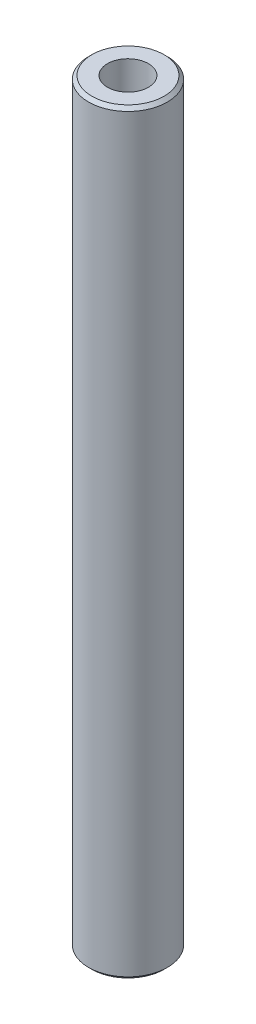
ISO-10303-21;
HEADER;
FILE_DESCRIPTION(('STEP AP214'),'2;1');
FILE_NAME('part.step','',(''),(''),'','','');
FILE_SCHEMA(('AUTOMOTIVE_DESIGN { 1 0 10303 214 1 1 1 1 }'));
ENDSEC;
DATA;
#1=APPLICATION_CONTEXT('core data for automotive mechanical design processes');
#2=APPLICATION_PROTOCOL_DEFINITION('international standard','automotive_design',2000,#1);
#3=PRODUCT_CONTEXT('',#1,'mechanical');
#4=PRODUCT('Part','Part','',(#3));
#5=PRODUCT_RELATED_PRODUCT_CATEGORY('part','',(#4));
#6=PRODUCT_DEFINITION_FORMATION('','',#4);
#7=PRODUCT_DEFINITION_CONTEXT('part definition',#1,'design');
#8=PRODUCT_DEFINITION('design','',#6,#7);
#9=PRODUCT_DEFINITION_SHAPE('','',#8);
#10=(LENGTH_UNIT() NAMED_UNIT(*) SI_UNIT(.MILLI.,.METRE.));
#11=(NAMED_UNIT(*) PLANE_ANGLE_UNIT() SI_UNIT($,.RADIAN.));
#12=(NAMED_UNIT(*) SI_UNIT($,.STERADIAN.) SOLID_ANGLE_UNIT());
#13=UNCERTAINTY_MEASURE_WITH_UNIT(LENGTH_MEASURE(1.E-05),#10,'distance_accuracy_value','');
#14=(GEOMETRIC_REPRESENTATION_CONTEXT(3) GLOBAL_UNCERTAINTY_ASSIGNED_CONTEXT((#13)) GLOBAL_UNIT_ASSIGNED_CONTEXT((#10,
#11,#12)) REPRESENTATION_CONTEXT('',''));
#15=CARTESIAN_POINT('',(0.,0.,0.));
#16=DIRECTION('',(0.,0.,1.));
#17=DIRECTION('',(1.,0.,0.));
#18=AXIS2_PLACEMENT_3D('',#15,#16,#17);
#19=CARTESIAN_POINT('',(0.,95.9293134690486,0.));
#20=DIRECTION('',(0.,-1.,0.));
#21=DIRECTION('',(0.,0.,-1.));
#22=AXIS2_PLACEMENT_3D('',#19,#20,#21);
#23=CYLINDRICAL_SURFACE('',#22,5.);
#24=CARTESIAN_POINT('',(0.,95.5037307714209,0.));
#25=DIRECTION('',(0.,1.,0.));
#26=DIRECTION('',(0.,0.,1.));
#27=AXIS2_PLACEMENT_3D('',#24,#25,#26);
#28=CIRCLE('',#27,5.);
#29=CARTESIAN_POINT('',(0.,95.5037307714209,5.));
#30=VERTEX_POINT('',#29);
#31=EDGE_CURVE('E50',#30,#30,#28,.F.);
#32=ORIENTED_EDGE('',*,*,#31,.T.);
#33=EDGE_LOOP('',(#32));
#34=FACE_BOUND('',#33,.T.);
#35=CARTESIAN_POINT('',(0.,0.425582697627727,0.));
#36=DIRECTION('',(0.,1.,0.));
#37=DIRECTION('',(0.,0.,1.));
#38=AXIS2_PLACEMENT_3D('',#35,#36,#37);
#39=CIRCLE('',#38,5.);
#40=CARTESIAN_POINT('',(0.,0.425582697627727,5.));
#41=VERTEX_POINT('',#40);
#42=EDGE_CURVE('E51',#41,#41,#39,.T.);
#43=ORIENTED_EDGE('',*,*,#42,.T.);
#44=EDGE_LOOP('',(#43));
#45=FACE_BOUND('',#44,.T.);
#46=ADVANCED_FACE('F39',(#34,#45),#23,.T.);
#47=CARTESIAN_POINT('',(0.,95.9293134690486,0.));
#48=DIRECTION('',(0.,1.,0.));
#49=DIRECTION('',(0.,0.,1.));
#50=AXIS2_PLACEMENT_3D('',#47,#48,#49);
#51=PLANE('',#50);
#52=CARTESIAN_POINT('',(0.,95.9293134690486,0.));
#53=DIRECTION('',(0.,1.,0.));
#54=DIRECTION('',(0.,0.,1.));
#55=AXIS2_PLACEMENT_3D('',#52,#53,#54);
#56=CIRCLE('',#55,4.57441730237225);
#57=CARTESIAN_POINT('',(0.,95.9293134690486,4.57441730237225));
#58=VERTEX_POINT('',#57);
#59=EDGE_CURVE('E54',#58,#58,#56,.T.);
#60=ORIENTED_EDGE('',*,*,#59,.T.);
#61=EDGE_LOOP('',(#60));
#62=FACE_BOUND('',#61,.T.);
#63=CARTESIAN_POINT('',(0.,95.9293134690486,0.));
#64=DIRECTION('',(0.,1.,0.));
#65=DIRECTION('',(0.,0.,1.));
#66=AXIS2_PLACEMENT_3D('',#63,#64,#65);
#67=CIRCLE('',#66,2.59944605677494);
#68=CARTESIAN_POINT('',(0.,95.9293134690486,2.59944605677494));
#69=VERTEX_POINT('',#68);
#70=EDGE_CURVE('E58',#69,#69,#67,.T.);
#71=ORIENTED_EDGE('',*,*,#70,.F.);
#72=EDGE_LOOP('',(#71));
#73=FACE_BOUND('',#72,.T.);
#74=ADVANCED_FACE('F69',(#62,#73),#51,.T.);
#75=CARTESIAN_POINT('',(0.,0.,0.));
#76=DIRECTION('',(0.,1.,0.));
#77=DIRECTION('',(0.,0.,1.));
#78=AXIS2_PLACEMENT_3D('',#75,#76,#77);
#79=PLANE('',#78);
#80=CARTESIAN_POINT('',(0.,0.,0.));
#81=DIRECTION('',(0.,1.,0.));
#82=DIRECTION('',(0.,0.,1.));
#83=AXIS2_PLACEMENT_3D('',#80,#81,#82);
#84=CIRCLE('',#83,4.57441730237226);
#85=CARTESIAN_POINT('',(0.,0.,4.57441730237226));
#86=VERTEX_POINT('',#85);
#87=EDGE_CURVE('E10',#86,#86,#84,.F.);
#88=ORIENTED_EDGE('',*,*,#87,.T.);
#89=EDGE_LOOP('',(#88));
#90=FACE_BOUND('',#89,.T.);
#91=CARTESIAN_POINT('',(0.,0.,0.));
#92=DIRECTION('',(0.,1.,0.));
#93=DIRECTION('',(0.,0.,1.));
#94=AXIS2_PLACEMENT_3D('',#91,#92,#93);
#95=CIRCLE('',#94,2.59944605677494);
#96=CARTESIAN_POINT('',(0.,0.,2.59944605677494));
#97=VERTEX_POINT('',#96);
#98=EDGE_CURVE('E63',#97,#97,#95,.T.);
#99=ORIENTED_EDGE('',*,*,#98,.T.);
#100=EDGE_LOOP('',(#99));
#101=FACE_BOUND('',#100,.T.);
#102=ADVANCED_FACE('F75',(#90,#101),#79,.F.);
#103=CARTESIAN_POINT('',(0.,95.9293134690486,0.));
#104=DIRECTION('',(0.,-1.,0.));
#105=DIRECTION('',(0.,0.,-1.));
#106=AXIS2_PLACEMENT_3D('',#103,#104,#105);
#107=CYLINDRICAL_SURFACE('',#106,2.59944605677494);
#108=ORIENTED_EDGE('',*,*,#70,.T.);
#109=EDGE_LOOP('',(#108));
#110=FACE_BOUND('',#109,.T.);
#111=ORIENTED_EDGE('',*,*,#98,.F.);
#112=EDGE_LOOP('',(#111));
#113=FACE_BOUND('',#112,.T.);
#114=ADVANCED_FACE('F70',(#110,#113),#107,.F.);
#115=CARTESIAN_POINT('',(0.,95.9293134690486,0.));
#116=DIRECTION('',(0.,-1.,0.));
#117=DIRECTION('',(0.,0.,-1.));
#118=AXIS2_PLACEMENT_3D('',#115,#116,#117);
#119=CONICAL_SURFACE('',#118,4.57441730237225,0.785398163397443);
#120=ORIENTED_EDGE('',*,*,#31,.F.);
#121=EDGE_LOOP('',(#120));
#122=FACE_BOUND('',#121,.T.);
#123=ORIENTED_EDGE('',*,*,#59,.F.);
#124=EDGE_LOOP('',(#123));
#125=FACE_BOUND('',#124,.T.);
#126=ADVANCED_FACE('F81',(#122,#125),#119,.T.);
#127=CARTESIAN_POINT('',(0.,0.425582697627727,0.));
#128=DIRECTION('',(0.,1.,0.));
#129=DIRECTION('',(0.,0.,1.));
#130=AXIS2_PLACEMENT_3D('',#127,#128,#129);
#131=CONICAL_SURFACE('',#130,5.,0.785398163397459);
#132=ORIENTED_EDGE('',*,*,#87,.F.);
#133=EDGE_LOOP('',(#132));
#134=FACE_BOUND('',#133,.T.);
#135=ORIENTED_EDGE('',*,*,#42,.F.);
#136=EDGE_LOOP('',(#135));
#137=FACE_BOUND('',#136,.T.);
#138=ADVANCED_FACE('F45',(#134,#137),#131,.T.);
#139=CLOSED_SHELL('',(#46,#74,#102,#114,#126,#138));
#140=MANIFOLD_SOLID_BREP('B2',#139);
#141=ADVANCED_BREP_SHAPE_REPRESENTATION('',(#18,#140),#14);
#142=SHAPE_DEFINITION_REPRESENTATION(#9,#141);
ENDSEC;
END-ISO-10303-21;
